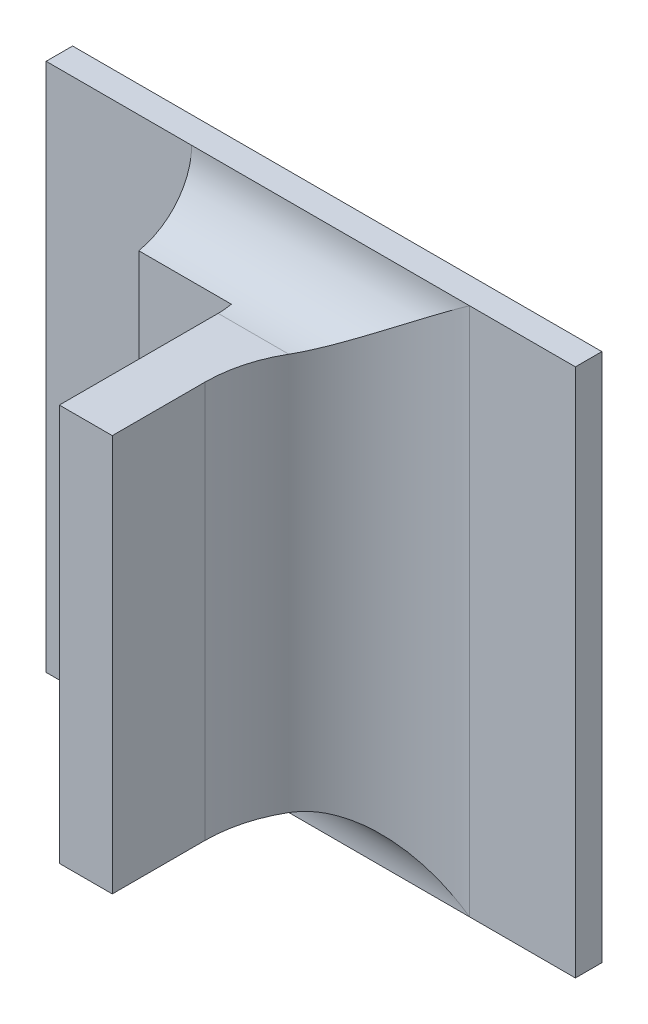
ISO-10303-21;
HEADER;
FILE_DESCRIPTION(('STEP AP214'),'2;1');
FILE_NAME('part.step','',(''),(''),'','','');
FILE_SCHEMA(('AUTOMOTIVE_DESIGN { 1 0 10303 214 1 1 1 1 }'));
ENDSEC;
DATA;
#1=APPLICATION_CONTEXT('core data for automotive mechanical design processes');
#2=APPLICATION_PROTOCOL_DEFINITION('international standard','automotive_design',2000,#1);
#3=PRODUCT_CONTEXT('',#1,'mechanical');
#4=PRODUCT('Part','Part','',(#3));
#5=PRODUCT_RELATED_PRODUCT_CATEGORY('part','',(#4));
#6=PRODUCT_DEFINITION_FORMATION('','',#4);
#7=PRODUCT_DEFINITION_CONTEXT('part definition',#1,'design');
#8=PRODUCT_DEFINITION('design','',#6,#7);
#9=PRODUCT_DEFINITION_SHAPE('','',#8);
#10=(LENGTH_UNIT() NAMED_UNIT(*) SI_UNIT(.MILLI.,.METRE.));
#11=(NAMED_UNIT(*) PLANE_ANGLE_UNIT() SI_UNIT($,.RADIAN.));
#12=(NAMED_UNIT(*) SI_UNIT($,.STERADIAN.) SOLID_ANGLE_UNIT());
#13=UNCERTAINTY_MEASURE_WITH_UNIT(LENGTH_MEASURE(1.E-05),#10,'distance_accuracy_value','');
#14=(GEOMETRIC_REPRESENTATION_CONTEXT(3) GLOBAL_UNCERTAINTY_ASSIGNED_CONTEXT((#13)) GLOBAL_UNIT_ASSIGNED_CONTEXT((#10,
#11,#12)) REPRESENTATION_CONTEXT('',''));
#15=CARTESIAN_POINT('',(0.,0.,0.));
#16=DIRECTION('',(0.,0.,1.));
#17=DIRECTION('',(1.,0.,0.));
#18=AXIS2_PLACEMENT_3D('',#15,#16,#17);
#19=CARTESIAN_POINT('',(1.10065854933629,-0.311549667580545,0.0796271653543306));
#20=DIRECTION('',(-1.,0.,0.));
#21=DIRECTION('',(0.,-1.,0.));
#22=AXIS2_PLACEMENT_3D('',#19,#20,#21);
#23=PLANE('',#22);
#24=DIRECTION('',(0.,-1.,0.));
#25=VECTOR('',#24,1.);
#26=CARTESIAN_POINT('',(1.10065854933629,-0.360053604588419,0.0800681102362204));
#27=LINE('',#26,#25);
#28=CARTESIAN_POINT('',(1.10065854933629,-0.351234706950624,0.0800681102362204));
#29=VERTEX_POINT('',#28);
#30=CARTESIAN_POINT('',(1.10065854933629,-0.313439431360073,0.0800681102362204));
#31=VERTEX_POINT('',#30);
#32=EDGE_CURVE('E116',#29,#31,#27,.F.);
#33=ORIENTED_EDGE('',*,*,#32,.T.);
#34=DIRECTION('',(0.,0.,1.));
#35=VECTOR('',#34,1.);
#36=CARTESIAN_POINT('',(1.10065854933629,-0.313439431360073,0.0730129921259841));
#37=LINE('',#36,#35);
#38=CARTESIAN_POINT('',(1.10065854933629,-0.313439431360073,0.0888870078740156));
#39=VERTEX_POINT('',#38);
#40=EDGE_CURVE('E294',#39,#31,#37,.F.);
#41=ORIENTED_EDGE('',*,*,#40,.F.);
#42=DIRECTION('',(0.,1.,0.));
#43=VECTOR('',#42,1.);
#44=CARTESIAN_POINT('',(1.10065854933629,-0.311549667580545,0.0888870078740156));
#45=LINE('',#44,#43);
#46=CARTESIAN_POINT('',(1.10065854933629,-0.351234706950624,0.0888870078740156));
#47=VERTEX_POINT('',#46);
#48=EDGE_CURVE('E306',#39,#47,#45,.F.);
#49=ORIENTED_EDGE('',*,*,#48,.T.);
#50=DIRECTION('',(0.,0.,1.));
#51=VECTOR('',#50,1.);
#52=CARTESIAN_POINT('',(1.10065854933629,-0.351234706950624,0.0730129921259841));
#53=LINE('',#52,#51);
#54=EDGE_CURVE('E305',#47,#29,#53,.F.);
#55=ORIENTED_EDGE('',*,*,#54,.T.);
#56=EDGE_LOOP('',(#33,#41,#49,#55));
#57=FACE_BOUND('',#56,.T.);
#58=ADVANCED_FACE('F17',(#57),#23,.F.);
#59=CARTESIAN_POINT('',(1.09536721075361,-0.311549667580545,0.0888870078740156));
#60=DIRECTION('',(0.,0.,-1.));
#61=DIRECTION('',(-1.,0.,0.));
#62=AXIS2_PLACEMENT_3D('',#59,#60,#61);
#63=PLANE('',#62);
#64=DIRECTION('',(0.,1.,0.));
#65=VECTOR('',#64,1.);
#66=CARTESIAN_POINT('',(1.09561917925755,-0.35326446766354,0.0888870078740156));
#67=LINE('',#66,#65);
#68=CARTESIAN_POINT('',(1.09561917925755,-0.313439431360073,0.0888870078740156));
#69=VERTEX_POINT('',#68);
#70=CARTESIAN_POINT('',(1.09561917925755,-0.351234706950624,0.0888870078740156));
#71=VERTEX_POINT('',#70);
#72=EDGE_CURVE('E297',#69,#71,#67,.F.);
#73=ORIENTED_EDGE('',*,*,#72,.T.);
#74=DIRECTION('',(-1.,0.,0.));
#75=VECTOR('',#74,1.);
#76=CARTESIAN_POINT('',(1.10268278021536,-0.351234706950624,0.0888870078740156));
#77=LINE('',#76,#75);
#78=EDGE_CURVE('E302',#71,#47,#77,.F.);
#79=ORIENTED_EDGE('',*,*,#78,.T.);
#80=ORIENTED_EDGE('',*,*,#48,.F.);
#81=DIRECTION('',(-1.,0.,0.));
#82=VECTOR('',#81,1.);
#83=CARTESIAN_POINT('',(1.10268278021536,-0.313439431360073,0.0888870078740156));
#84=LINE('',#83,#82);
#85=EDGE_CURVE('E291',#69,#39,#84,.F.);
#86=ORIENTED_EDGE('',*,*,#85,.F.);
#87=EDGE_LOOP('',(#73,#79,#80,#86));
#88=FACE_BOUND('',#87,.T.);
#89=ADVANCED_FACE('F321',(#88),#63,.F.);
#90=CARTESIAN_POINT('',(1.10268278021536,-0.351234706950624,0.0730129921259841));
#91=DIRECTION('',(0.,1.,0.));
#92=DIRECTION('',(-1.,0.,0.));
#93=AXIS2_PLACEMENT_3D('',#90,#91,#92);
#94=PLANE('',#93);
#95=DIRECTION('',(-1.,0.,0.));
#96=VECTOR('',#95,1.);
#97=CARTESIAN_POINT('',(1.06034358870637,-0.351234706950624,0.0737688976377952));
#98=LINE('',#97,#96);
#99=CARTESIAN_POINT('',(1.09561917925755,-0.351234706950624,0.0737688976377952));
#100=VERTEX_POINT('',#99);
#101=CARTESIAN_POINT('',(1.10234641826499,-0.351234706950624,0.0737688976377951));
#102=VERTEX_POINT('',#101);
#103=EDGE_CURVE('E127',#100,#102,#98,.F.);
#104=ORIENTED_EDGE('',*,*,#103,.T.);
#105=CARTESIAN_POINT('',(1.11325697453314,-0.351234706950624,0.0800681102362204));
#106=DIRECTION('',(0.,-1.,0.));
#107=DIRECTION('',(1.,0.,0.));
#108=AXIS2_PLACEMENT_3D('',#105,#106,#107);
#109=CIRCLE('',#108,0.0125984251968504);
#110=EDGE_CURVE('E20',#102,#29,#109,.F.);
#111=ORIENTED_EDGE('',*,*,#110,.T.);
#112=ORIENTED_EDGE('',*,*,#54,.F.);
#113=ORIENTED_EDGE('',*,*,#78,.F.);
#114=DIRECTION('',(0.,0.,1.));
#115=VECTOR('',#114,1.);
#116=CARTESIAN_POINT('',(1.09561917925755,-0.351234706950624,0.0716901574803148));
#117=LINE('',#116,#115);
#118=EDGE_CURVE('E135',#71,#100,#117,.F.);
#119=ORIENTED_EDGE('',*,*,#118,.T.);
#120=EDGE_LOOP('',(#104,#111,#112,#113,#119));
#121=FACE_BOUND('',#120,.T.);
#122=ADVANCED_FACE('F133',(#121),#94,.F.);
#123=CARTESIAN_POINT('',(1.08635933673786,-0.311409670647157,0.0725090551181101));
#124=DIRECTION('',(0.,0.,-1.));
#125=DIRECTION('',(-1.,0.,0.));
#126=AXIS2_PLACEMENT_3D('',#123,#124,#125);
#127=PLANE('',#126);
#128=DIRECTION('',(1.,0.,0.));
#129=VECTOR('',#128,1.);
#130=CARTESIAN_POINT('',(1.11457980917881,-0.313312161420629,0.0725090551181101));
#131=LINE('',#130,#129);
#132=CARTESIAN_POINT('',(1.09561917925755,-0.313312161420629,0.0725090551181101));
#133=VERTEX_POINT('',#132);
#134=CARTESIAN_POINT('',(1.08680028161975,-0.313312161420629,0.0725090551181101));
#135=VERTEX_POINT('',#134);
#136=EDGE_CURVE('E142',#133,#135,#131,.F.);
#137=ORIENTED_EDGE('',*,*,#136,.T.);
#138=DIRECTION('',(0.,1.,0.));
#139=VECTOR('',#138,1.);
#140=CARTESIAN_POINT('',(1.08680028161975,-0.304620533722278,0.0725090551181101));
#141=LINE('',#140,#139);
#142=CARTESIAN_POINT('',(1.08680028161975,-0.351361976890068,0.0725090551181101));
#143=VERTEX_POINT('',#142);
#144=EDGE_CURVE('E146',#135,#143,#141,.F.);
#145=ORIENTED_EDGE('',*,*,#144,.T.);
#146=DIRECTION('',(-1.,0.,0.));
#147=VECTOR('',#146,1.);
#148=CARTESIAN_POINT('',(1.06034358870637,-0.351361976890068,0.0725090551181101));
#149=LINE('',#148,#147);
#150=CARTESIAN_POINT('',(1.09561917925755,-0.351361976890068,0.0725090551181101));
#151=VERTEX_POINT('',#150);
#152=EDGE_CURVE('E138',#143,#151,#149,.F.);
#153=ORIENTED_EDGE('',*,*,#152,.T.);
#154=DIRECTION('',(0.,1.,0.));
#155=VECTOR('',#154,1.);
#156=CARTESIAN_POINT('',(1.09561917925755,-0.35326446766354,0.0725090551181101));
#157=LINE('',#156,#155);
#158=EDGE_CURVE('E324',#151,#133,#157,.T.);
#159=ORIENTED_EDGE('',*,*,#158,.T.);
#160=EDGE_LOOP('',(#137,#145,#153,#159));
#161=FACE_BOUND('',#160,.T.);
#162=ADVANCED_FACE('F193',(#161),#127,.F.);
#163=CARTESIAN_POINT('',(1.11325697453314,-0.360053604588419,0.0800681102362204));
#164=DIRECTION('',(0.,-1.,0.));
#165=DIRECTION('',(1.,0.,0.));
#166=AXIS2_PLACEMENT_3D('',#163,#164,#165);
#167=CYLINDRICAL_SURFACE('',#166,0.0125984251968504);
#168=CARTESIAN_POINT('',(1.10234641826499,-0.351234706950624,0.073768897637795));
#169=CARTESIAN_POINT('',(1.10261890276947,-0.351235264602844,0.0732955457546591));
#170=CARTESIAN_POINT('',(1.10292101489507,-0.351287791933283,0.0728445682080297));
#171=CARTESIAN_POINT('',(1.10356648266907,-0.351472774611581,0.0720003898002663));
#172=CARTESIAN_POINT('',(1.10390921514433,-0.351604122731851,0.0716064807283954));
#173=CARTESIAN_POINT('',(1.1046944522691,-0.351954482138244,0.0708064921171963));
#174=CARTESIAN_POINT('',(1.10514352339741,-0.352185429374069,0.0704123993317733));
#175=CARTESIAN_POINT('',(1.10607344965901,-0.352703528005895,0.0697017381084181));
#176=CARTESIAN_POINT('',(1.1065544829297,-0.352991015612919,0.0693856602556568));
#177=CARTESIAN_POINT('',(1.1077352203742,-0.353727172372372,0.0687164538298326));
#178=CARTESIAN_POINT('',(1.10844449748557,-0.354193928271791,0.0684002761150405));
#179=CARTESIAN_POINT('',(1.10988152520042,-0.355165489292896,0.0679065689436589));
#180=CARTESIAN_POINT('',(1.1106092439602,-0.355670231444697,0.0677288153407497));
#181=CARTESIAN_POINT('',(1.11178520652968,-0.356494415867953,0.0675478835698786));
#182=CARTESIAN_POINT('',(1.11223106131395,-0.356808848945618,0.0675035718032502));
#183=CARTESIAN_POINT('',(1.11287048235852,-0.357260628255393,0.0674741343290926));
#184=CARTESIAN_POINT('',(1.11306373300818,-0.357397277676518,0.0674696949622004));
#185=CARTESIAN_POINT('',(1.11325697453314,-0.357533919549049,0.06746968503937));
#186=B_SPLINE_CURVE_WITH_KNOTS('',3,(#168,#169,#170,#171,#172,#173,#174,#175,#176,#177,#178,
#179,#180,#181,#182,#183,#184,#185),.UNSPECIFIED.,.F.,.F.,(4,2,2,2,2,2,2,2,4),(0.,
0.00162828046163546,0.00323420635682074,0.00514617952943936,0.00706988591555799,
0.00977367423346215,0.012473075225337,0.0141132082090729,0.014823218803943),.UNSPECIFIED.);
#187=CARTESIAN_POINT('',(1.11325697453314,-0.357533919549049,0.06746968503937));
#188=VERTEX_POINT('',#187);
#189=EDGE_CURVE('E113',#102,#188,#186,.T.);
#190=ORIENTED_EDGE('',*,*,#189,.T.);
#191=DIRECTION('',(0.,1.,0.));
#192=VECTOR('',#191,1.);
#193=CARTESIAN_POINT('',(1.11325697453314,-0.304620533722278,0.06746968503937));
#194=LINE('',#193,#192);
#195=CARTESIAN_POINT('',(1.11325697453314,-0.307140218761648,0.06746968503937));
#196=VERTEX_POINT('',#195);
#197=EDGE_CURVE('E279',#196,#188,#194,.F.);
#198=ORIENTED_EDGE('',*,*,#197,.F.);
#199=CARTESIAN_POINT('',(1.11325697453314,-0.307140218761648,0.06746968503937));
#200=CARTESIAN_POINT('',(1.11325697443883,-0.307140317600168,0.0674696850393615));
#201=CARTESIAN_POINT('',(1.11325696428831,-0.307140416428938,0.0674696850424135));
#202=CARTESIAN_POINT('',(1.11325692844536,-0.307140611354748,0.0674696850532618));
#203=CARTESIAN_POINT('',(1.11325690268731,-0.307140707438454,0.0674696850610781));
#204=CARTESIAN_POINT('',(1.11325683876529,-0.307140897584729,0.0674696850805152));
#205=CARTESIAN_POINT('',(1.11325680034771,-0.30714099156009,0.0674696850922137));
#206=CARTESIAN_POINT('',(1.11325671409872,-0.307141174837888,0.0674696851185221));
#207=CARTESIAN_POINT('',(1.11325666627737,-0.307141264145186,0.067469685133129));
#208=CARTESIAN_POINT('',(1.11325650386637,-0.307141540902339,0.0674696851828237));
#209=CARTESIAN_POINT('',(1.11325637660556,-0.307141720962886,0.0674696852218837));
#210=CARTESIAN_POINT('',(1.11325610177284,-0.307142061590547,0.0674696853066755));
#211=CARTESIAN_POINT('',(1.11325595436569,-0.307142222297702,0.0674696853523532));
#212=CARTESIAN_POINT('',(1.11325542712555,-0.30714275975848,0.0674696855167746));
#213=CARTESIAN_POINT('',(1.1132550209339,-0.307143110950677,0.0674696856452023));
#214=CARTESIAN_POINT('',(1.11325418097794,-0.307143742641604,0.0674696859163222));
#215=CARTESIAN_POINT('',(1.11325374865666,-0.307144025168177,0.0674696860583659));
#216=CARTESIAN_POINT('',(1.11325207047987,-0.307145088805981,0.0674696866214032));
#217=CARTESIAN_POINT('',(1.11325079788728,-0.307145826268706,0.0674696870727232));
#218=CARTESIAN_POINT('',(1.11324832352845,-0.307147133962223,0.0674696882497374));
#219=CARTESIAN_POINT('',(1.11324712675437,-0.307147713460052,0.0674696889448008));
#220=CARTESIAN_POINT('',(1.11323926691833,-0.307151849249196,0.0674696947394657));
#221=CARTESIAN_POINT('',(1.11323331635703,-0.307156609323054,0.067469705198469));
#222=CARTESIAN_POINT('',(1.11321123423804,-0.307173483152929,0.0674697594501571));
#223=CARTESIAN_POINT('',(1.11319458949083,-0.307184696077487,0.0674698297573796));
#224=CARTESIAN_POINT('',(1.11313382174648,-0.307226386954017,0.0674702062030111));
#225=CARTESIAN_POINT('',(1.1130902162084,-0.307257775090299,0.0674707100991553));
#226=CARTESIAN_POINT('',(1.11292384861855,-0.307376764604737,0.0674735003948733));
#227=CARTESIAN_POINT('',(1.11280055643069,-0.307463363679941,0.0674773623702134));
#228=CARTESIAN_POINT('',(1.11176052177526,-0.308194415116372,0.0675251688134003));
#229=CARTESIAN_POINT('',(1.11084596611058,-0.308840824556344,0.0676670910917156));
#230=CARTESIAN_POINT('',(1.10918262551351,-0.309985925569803,0.0681207439021359));
#231=CARTESIAN_POINT('',(1.10843045895855,-0.310491829145844,0.0684021380812103));
#232=CARTESIAN_POINT('',(1.10720054658299,-0.311283401329248,0.0690071450776349));
#233=CARTESIAN_POINT('',(1.10671313105087,-0.311587175065945,0.0692872417521838));
#234=CARTESIAN_POINT('',(1.10574606227079,-0.312158547189347,0.0699361732585047));
#235=CARTESIAN_POINT('',(1.10526722125112,-0.312424585539931,0.0703076754457102));
#236=CARTESIAN_POINT('',(1.10446921276298,-0.312823166861075,0.0710290250498738));
#237=CARTESIAN_POINT('',(1.10414088565085,-0.31297243520059,0.0713594163896827));
#238=CARTESIAN_POINT('',(1.10351681043465,-0.313215602302386,0.0720638443645074));
#239=CARTESIAN_POINT('',(1.10322081460992,-0.313309950219131,0.0724374961036001));
#240=CARTESIAN_POINT('',(1.10272701699477,-0.313415914374917,0.0731410386617688));
#241=CARTESIAN_POINT('',(1.10252166045462,-0.31344076414939,0.0734635869359734));
#242=CARTESIAN_POINT('',(1.10214103529335,-0.313437989894047,0.0741265585439531));
#243=CARTESIAN_POINT('',(1.10196578800616,-0.31341032882348,0.0744669943307325));
#244=CARTESIAN_POINT('',(1.10164914342728,-0.313294679389271,0.0751565544091362));
#245=CARTESIAN_POINT('',(1.10150798460914,-0.313206281764493,0.0755057220621307));
#246=CARTESIAN_POINT('',(1.10126317815291,-0.312965001062621,0.0761947785868873));
#247=CARTESIAN_POINT('',(1.10115950288724,-0.312812165660658,0.076534674121198));
#248=CARTESIAN_POINT('',(1.10099779917462,-0.312466071945116,0.0771489075153615));
#249=CARTESIAN_POINT('',(1.10093578034486,-0.312279886373216,0.0774262133810266));
#250=CARTESIAN_POINT('',(1.1008349727764,-0.311863410254162,0.0779502251276347));
#251=CARTESIAN_POINT('',(1.10079618395166,-0.311633119870385,0.0781969311219234));
#252=CARTESIAN_POINT('',(1.10073691438072,-0.311139310998908,0.0786471201676946));
#253=CARTESIAN_POINT('',(1.10071611863725,-0.310876460373297,0.0788512972752939));
#254=CARTESIAN_POINT('',(1.10068606880267,-0.31032143341996,0.0792159384509798));
#255=CARTESIAN_POINT('',(1.10067681628568,-0.310029253098466,0.079376396554856));
#256=CARTESIAN_POINT('',(1.10066451824179,-0.309410568564247,0.0796549300095398));
#257=CARTESIAN_POINT('',(1.10066174556578,-0.309083144094315,0.0797709755115422));
#258=CARTESIAN_POINT('',(1.1006588120244,-0.308413669505017,0.0799477574285474));
#259=CARTESIAN_POINT('',(1.10065865145093,-0.308071617755308,0.0800084876612566));
#260=CARTESIAN_POINT('',(1.10065850513026,-0.307374847298272,0.0800736589499428));
#261=CARTESIAN_POINT('',(1.10065852316003,-0.307020013767971,0.0800768798691539));
#262=CARTESIAN_POINT('',(1.10065860056997,-0.306314811859268,0.0800238026376848));
#263=CARTESIAN_POINT('',(1.10065865995291,-0.305964443781738,0.0799675004977202));
#264=CARTESIAN_POINT('',(1.10066118345469,-0.305277507288453,0.0797968199531622));
#265=CARTESIAN_POINT('',(1.1006636517146,-0.304940963676405,0.0796823417014522));
#266=CARTESIAN_POINT('',(1.1006755577209,-0.30429193671443,0.079398533160437));
#267=CARTESIAN_POINT('',(1.10068499571833,-0.30397945423159,0.079229200895512));
#268=CARTESIAN_POINT('',(1.10071686610112,-0.303389548026495,0.078841988199416));
#269=CARTESIAN_POINT('',(1.10073921968553,-0.303111924019512,0.0786244070629531));
#270=CARTESIAN_POINT('',(1.10080350767794,-0.302598008180998,0.0781473882147606));
#271=CARTESIAN_POINT('',(1.10084543461465,-0.30236170062595,0.0778879664985859));
#272=CARTESIAN_POINT('',(1.1009530271785,-0.301944772977547,0.0773466142760768));
#273=CARTESIAN_POINT('',(1.10101781463972,-0.301762499248574,0.0770657832005056));
#274=CARTESIAN_POINT('',(1.10117507606754,-0.301447086827108,0.0764850450664439));
#275=CARTESIAN_POINT('',(1.10126754153052,-0.301313933071312,0.0761851438891881));
#276=CARTESIAN_POINT('',(1.10147846113475,-0.301100802250232,0.0755865038391838));
#277=CARTESIAN_POINT('',(1.10159610402998,-0.301019424424719,0.0752879731287242));
#278=CARTESIAN_POINT('',(1.10185781902439,-0.300901879920434,0.0746936193238617));
#279=CARTESIAN_POINT('',(1.10200190499721,-0.300865737052864,0.0743977977367697));
#280=CARTESIAN_POINT('',(1.10232401499384,-0.300833457265666,0.0737980252798642));
#281=CARTESIAN_POINT('',(1.10250363576731,-0.300840072083108,0.0734947949351434));
#282=CARTESIAN_POINT('',(1.10288546654942,-0.300893220663338,0.0729074487273724));
#283=CARTESIAN_POINT('',(1.10308765539436,-0.300939717295166,0.07262331534983));
#284=CARTESIAN_POINT('',(1.10362236409069,-0.301099160254376,0.0719334846819084));
#285=CARTESIAN_POINT('',(1.10396744068269,-0.301234206619572,0.0715425793781453));
#286=CARTESIAN_POINT('',(1.10469211824112,-0.301562359739769,0.0708143812686403));
#287=CARTESIAN_POINT('',(1.1050720571188,-0.301756088608605,0.0704777252629507));
#288=CARTESIAN_POINT('',(1.10602672299861,-0.302279339643324,0.0697260645086063));
#289=CARTESIAN_POINT('',(1.10661350381228,-0.302631080843893,0.0693419139325728));
#290=CARTESIAN_POINT('',(1.10778838585876,-0.303370485460523,0.0686995101782903));
#291=CARTESIAN_POINT('',(1.10837539859386,-0.303756022313255,0.0684366507296656));
#292=CARTESIAN_POINT('',(1.10952428856556,-0.304528568289244,0.0680209366897775));
#293=CARTESIAN_POINT('',(1.11008520903677,-0.304913742395931,0.0678618837368313));
#294=CARTESIAN_POINT('',(1.1113216031066,-0.305774456157341,0.0676002423539604));
#295=CARTESIAN_POINT('',(1.11199849379879,-0.306253204314874,0.0675142406050075));
#296=CARTESIAN_POINT('',(1.11280003458979,-0.306816723517622,0.0674773844657497));
#297=CARTESIAN_POINT('',(1.11292282744822,-0.306902958808099,0.0674735321464732));
#298=CARTESIAN_POINT('',(1.11308904884134,-0.307021838644933,0.0674707243957126));
#299=CARTESIAN_POINT('',(1.11313300992244,-0.307053485081973,0.0674702128513251));
#300=CARTESIAN_POINT('',(1.11319425554291,-0.307095501849072,0.0674698312735403));
#301=CARTESIAN_POINT('',(1.11321101706482,-0.307106792621677,0.0674697601164234));
#302=CARTESIAN_POINT('',(1.11323323783695,-0.307123774563246,0.067469705327429));
#303=CARTESIAN_POINT('',(1.1132392147914,-0.307128556132832,0.0674696947878421));
#304=CARTESIAN_POINT('',(1.11324710881166,-0.307132705901442,0.0674696889590613));
#305=CARTESIAN_POINT('',(1.11324830876352,-0.307133286333551,0.0674696882612312));
#306=CARTESIAN_POINT('',(1.11325078959689,-0.307134597075485,0.0674696870796236));
#307=CARTESIAN_POINT('',(1.11325206542456,-0.307135336773202,0.0674696866266876));
#308=CARTESIAN_POINT('',(1.11325374726028,-0.307136403621154,0.0674696860616838));
#309=CARTESIAN_POINT('',(1.11325418021959,-0.307136686826689,0.0674696859192267));
#310=CARTESIAN_POINT('',(1.11325502129302,-0.307137320138761,0.0674696856472792));
#311=CARTESIAN_POINT('',(1.11325542795451,-0.307137672284289,0.0674696855184389));
#312=CARTESIAN_POINT('',(1.11325595560389,-0.30713821114919,0.0674696853534853));
#313=CARTESIAN_POINT('',(1.11325610307399,-0.307138372237131,0.067469685307667));
#314=CARTESIAN_POINT('',(1.11325637795344,-0.307138713663398,0.0674696852226042));
#315=CARTESIAN_POINT('',(1.11325650519712,-0.30713889414225,0.0674696851834138));
#316=CARTESIAN_POINT('',(1.11325666749389,-0.307139171508259,0.0674696851335454));
#317=CARTESIAN_POINT('',(1.1132567152638,-0.307139261001292,0.067469685118887));
#318=CARTESIAN_POINT('',(1.11325680137935,-0.30713944464998,0.0674696850924812));
#319=CARTESIAN_POINT('',(1.11325683971488,-0.307139538810509,0.067469685080737));
#320=CARTESIAN_POINT('',(1.11325690343592,-0.307139729312035,0.067469685061218));
#321=CARTESIAN_POINT('',(1.11325692907626,-0.307139825565832,0.0674696850533652));
#322=CARTESIAN_POINT('',(1.11325696463911,-0.307140020812425,0.0674696850424555));
#323=CARTESIAN_POINT('',(1.11325697462758,-0.307140119791924,0.0674696850393785));
#324=CARTESIAN_POINT('',(1.11325697453314,-0.307140218761648,0.06746968503937));
#325=B_SPLINE_CURVE_WITH_KNOTS('',3,(#199,#200,#201,#202,#203,#204,#205,#206,#207,#208,#209,
#210,#211,#212,#213,#214,#215,#216,#217,#218,#219,#220,#221,#222,#223,#224,#225,#226,#227,#228,
#229,#230,#231,#232,#233,#234,#235,#236,#237,#238,#239,#240,#241,#242,#243,#244,#245,#246,#247,
#248,#249,#250,#251,#252,#253,#254,#255,#256,#257,#258,#259,#260,#261,#262,#263,#264,#265,#266,
#267,#268,#269,#270,#271,#272,#273,#274,#275,#276,#277,#278,#279,#280,#281,#282,#283,#284,#285,
#286,#287,#288,#289,#290,#291,#292,#293,#294,#295,#296,#297,#298,#299,#300,#301,#302,#303,#304,
#305,#306,#307,#308,#309,#310,#311,#312,#313,#314,#315,#316,#317,#318,#319,#320,#321,#322,#323,
#324),.UNSPECIFIED.,.T.,.F.,(4,2,2,2,2,2,2,2,2,2,2,2,2,2,2,2,2,2,2,2,2,2,2,2,2,2,2,2,2,2,2,2,2,
2,2,2,2,2,2,2,2,2,2,2,2,2,2,2,2,2,2,2,2,2,2,2,2,2,2,2,2,2,4),(0.,2.96262718467022E-07,
5.9377935599324E-07,8.9766057151907E-07,1.20121869978616E-06,1.85983939931601E-06,
2.51336440042427E-06,4.11695718378894E-06,5.66498675241026E-06,1.00742722997459E-05,
1.40586629771078E-05,3.67471450075659E-05,9.70745534323149E-05,0.000258117828158545,
0.000710418104869135,0.00407475533961842,0.00690809627288576,0.00881968522125077,
0.0107955574621806,0.0122580167053816,0.0137083411294307,0.0148534027078702,0.0159992723041916,
0.0171529398267009,0.0183057552869511,0.0193199166517908,0.0203340742599354,0.0213300957694083,
0.0223262530896367,0.0233636546164693,0.0244011720739369,0.0254606762934845,0.0265202515263762,
0.0275816514712123,0.0286430896476356,0.0296981191234643,0.0307527462159096,0.0317706214790939,
0.0327881843370709,0.0337768943877514,0.034766124666293,0.0358196249691737,0.0368721455004046,
0.0384790134244904,0.040103550775021,0.0424440092075651,0.0446862628276771,0.0467780451238264,
0.0492693497424136,0.049719781732113,0.0498821419378973,0.0499428919104113,0.049965681046058,
0.0499696752051923,0.0499740961721066,0.049975646909701,0.0499772533934871,0.0499779078855008,
0.0499785674893831,0.049978871464854,0.0499791757647539,0.0499794736800123,0.0499797703360084),.UNSPECIFIED.);
#326=CARTESIAN_POINT('',(1.10234641826499,-0.313439431360073,0.0737688976377952));
#327=VERTEX_POINT('',#326);
#328=EDGE_CURVE('E197',#196,#327,#325,.T.);
#329=ORIENTED_EDGE('',*,*,#328,.T.);
#330=CARTESIAN_POINT('',(1.11325697453314,-0.313439431360073,0.0800681102362204));
#331=DIRECTION('',(0.,1.,0.));
#332=DIRECTION('',(-1.,0.,0.));
#333=AXIS2_PLACEMENT_3D('',#330,#331,#332);
#334=CIRCLE('',#333,0.0125984251968504);
#335=EDGE_CURVE('E121',#31,#327,#334,.F.);
#336=ORIENTED_EDGE('',*,*,#335,.F.);
#337=ORIENTED_EDGE('',*,*,#32,.F.);
#338=ORIENTED_EDGE('',*,*,#110,.F.);
#339=EDGE_LOOP('',(#190,#198,#329,#336,#337,#338));
#340=FACE_BOUND('',#339,.T.);
#341=ADVANCED_FACE('F111',(#340),#167,.F.);
#342=CARTESIAN_POINT('',(1.10268278021536,-0.313439431360073,0.0730129921259841));
#343=DIRECTION('',(0.,1.,0.));
#344=DIRECTION('',(-1.,0.,0.));
#345=AXIS2_PLACEMENT_3D('',#342,#343,#344);
#346=PLANE('',#345);
#347=ORIENTED_EDGE('',*,*,#85,.T.);
#348=ORIENTED_EDGE('',*,*,#40,.T.);
#349=ORIENTED_EDGE('',*,*,#335,.T.);
#350=DIRECTION('',(1.,0.,0.));
#351=VECTOR('',#350,1.);
#352=CARTESIAN_POINT('',(1.11457980917881,-0.313439431360073,0.0737688976377952));
#353=LINE('',#352,#351);
#354=CARTESIAN_POINT('',(1.09561917925755,-0.313439431360073,0.0737688976377952));
#355=VERTEX_POINT('',#354);
#356=EDGE_CURVE('E266',#327,#355,#353,.F.);
#357=ORIENTED_EDGE('',*,*,#356,.T.);
#358=DIRECTION('',(0.,0.,1.));
#359=VECTOR('',#358,1.);
#360=CARTESIAN_POINT('',(1.09561917925755,-0.313439431360073,0.0716901574803148));
#361=LINE('',#360,#359);
#362=EDGE_CURVE('E149',#355,#69,#361,.T.);
#363=ORIENTED_EDGE('',*,*,#362,.T.);
#364=EDGE_LOOP('',(#347,#348,#349,#357,#363));
#365=FACE_BOUND('',#364,.T.);
#366=ADVANCED_FACE('F183',(#365),#346,.T.);
#367=CARTESIAN_POINT('',(1.09561917925755,-0.35326446766354,0.0716901574803148));
#368=DIRECTION('',(1.,0.,0.));
#369=DIRECTION('',(0.,1.,0.));
#370=AXIS2_PLACEMENT_3D('',#367,#368,#369);
#371=PLANE('',#370);
#372=CARTESIAN_POINT('',(1.09561917925755,-0.313312161420629,0.0725090551181101));
#373=CARTESIAN_POINT('',(1.09561917925755,-0.313439431360073,0.0731325479405746));
#374=CARTESIAN_POINT('',(1.09561917925755,-0.313439431360073,0.0737688976377952));
#375=B_SPLINE_CURVE_WITH_KNOTS('',2,(#372,#373,#374),.UNSPECIFIED.,.F.,.F.,(3,3),(0.,1.),.UNSPECIFIED.);
#376=EDGE_CURVE('E153',#355,#133,#375,.F.);
#377=ORIENTED_EDGE('',*,*,#376,.T.);
#378=ORIENTED_EDGE('',*,*,#158,.F.);
#379=CARTESIAN_POINT('',(1.09561917925755,-0.351234706950624,0.0737688976377952));
#380=CARTESIAN_POINT('',(1.09561917925755,-0.351234706950624,0.0731325479405747));
#381=CARTESIAN_POINT('',(1.09561917925755,-0.351361976890068,0.0725090551181101));
#382=B_SPLINE_CURVE_WITH_KNOTS('',2,(#379,#380,#381),.UNSPECIFIED.,.F.,.F.,(3,3),(0.,1.),.UNSPECIFIED.);
#383=EDGE_CURVE('E136',#151,#100,#382,.F.);
#384=ORIENTED_EDGE('',*,*,#383,.T.);
#385=ORIENTED_EDGE('',*,*,#118,.F.);
#386=ORIENTED_EDGE('',*,*,#72,.F.);
#387=ORIENTED_EDGE('',*,*,#362,.F.);
#388=EDGE_LOOP('',(#377,#378,#384,#385,#386,#387));
#389=FACE_BOUND('',#388,.T.);
#390=ADVANCED_FACE('F172',(#389),#371,.F.);
#391=CARTESIAN_POINT('',(1.08680028161975,-0.304620533722278,0.067217716535433));
#392=DIRECTION('',(1.,0.,0.));
#393=DIRECTION('',(0.,1.,0.));
#394=AXIS2_PLACEMENT_3D('',#391,#392,#393);
#395=PLANE('',#394);
#396=CARTESIAN_POINT('',(1.08680028161975,-0.307140218761648,0.0737688976377952));
#397=DIRECTION('',(1.,0.,0.));
#398=DIRECTION('',(0.,1.,0.));
#399=AXIS2_PLACEMENT_3D('',#396,#397,#398);
#400=CIRCLE('',#399,0.0062992125984252);
#401=CARTESIAN_POINT('',(1.08680028161975,-0.307140218761648,0.06746968503937));
#402=VERTEX_POINT('',#401);
#403=EDGE_CURVE('E272',#135,#402,#400,.T.);
#404=ORIENTED_EDGE('',*,*,#403,.T.);
#405=DIRECTION('',(0.,1.,0.));
#406=VECTOR('',#405,1.);
#407=CARTESIAN_POINT('',(1.08680028161975,-0.304620533722278,0.06746968503937));
#408=LINE('',#407,#406);
#409=CARTESIAN_POINT('',(1.08680028161975,-0.357533919549049,0.06746968503937));
#410=VERTEX_POINT('',#409);
#411=EDGE_CURVE('E150',#410,#402,#408,.T.);
#412=ORIENTED_EDGE('',*,*,#411,.F.);
#413=CARTESIAN_POINT('',(1.08680028161975,-0.357533919549049,0.0737688976377952));
#414=DIRECTION('',(-1.,0.,0.));
#415=DIRECTION('',(0.,-1.,0.));
#416=AXIS2_PLACEMENT_3D('',#413,#414,#415);
#417=CIRCLE('',#416,0.0062992125984252);
#418=EDGE_CURVE('E131',#410,#143,#417,.F.);
#419=ORIENTED_EDGE('',*,*,#418,.T.);
#420=ORIENTED_EDGE('',*,*,#144,.F.);
#421=EDGE_LOOP('',(#404,#412,#419,#420));
#422=FACE_BOUND('',#421,.T.);
#423=ADVANCED_FACE('F182',(#422),#395,.F.);
#424=CARTESIAN_POINT('',(1.06034358870637,-0.357533919549049,0.0737688976377952));
#425=DIRECTION('',(-1.,0.,0.));
#426=DIRECTION('',(0.,-1.,0.));
#427=AXIS2_PLACEMENT_3D('',#424,#425,#426);
#428=CYLINDRICAL_SURFACE('',#427,0.0062992125984252);
#429=DIRECTION('',(-1.,0.,0.));
#430=VECTOR('',#429,1.);
#431=CARTESIAN_POINT('',(1.12585539972999,-0.357533919549049,0.06746968503937));
#432=LINE('',#431,#430);
#433=EDGE_CURVE('E130',#410,#188,#432,.F.);
#434=ORIENTED_EDGE('',*,*,#433,.T.);
#435=ORIENTED_EDGE('',*,*,#189,.F.);
#436=ORIENTED_EDGE('',*,*,#103,.F.);
#437=ORIENTED_EDGE('',*,*,#383,.F.);
#438=ORIENTED_EDGE('',*,*,#152,.F.);
#439=ORIENTED_EDGE('',*,*,#418,.F.);
#440=EDGE_LOOP('',(#434,#435,#436,#437,#438,#439));
#441=FACE_BOUND('',#440,.T.);
#442=ADVANCED_FACE('F125',(#441),#428,.F.);
#443=CARTESIAN_POINT('',(1.12383965169849,-0.304620533722278,0.06746968503937));
#444=DIRECTION('',(0.,0.,1.));
#445=DIRECTION('',(1.,0.,0.));
#446=AXIS2_PLACEMENT_3D('',#443,#444,#445);
#447=PLANE('',#446);
#448=DIRECTION('',(0.,-1.,0.));
#449=VECTOR('',#448,1.);
#450=CARTESIAN_POINT('',(1.12333571469062,-0.304620533722278,0.06746968503937));
#451=LINE('',#450,#449);
#452=CARTESIAN_POINT('',(1.12333571469062,-0.357533919549049,0.06746968503937));
#453=VERTEX_POINT('',#452);
#454=CARTESIAN_POINT('',(1.12333571469062,-0.307140218761648,0.06746968503937));
#455=VERTEX_POINT('',#454);
#456=EDGE_CURVE('E262',#453,#455,#451,.F.);
#457=ORIENTED_EDGE('',*,*,#456,.T.);
#458=DIRECTION('',(1.,0.,0.));
#459=VECTOR('',#458,1.);
#460=CARTESIAN_POINT('',(1.07042232886385,-0.307140218761648,0.06746968503937));
#461=LINE('',#460,#459);
#462=EDGE_CURVE('E166',#455,#196,#461,.F.);
#463=ORIENTED_EDGE('',*,*,#462,.T.);
#464=ORIENTED_EDGE('',*,*,#197,.T.);
#465=DIRECTION('',(-1.,0.,0.));
#466=VECTOR('',#465,1.);
#467=CARTESIAN_POINT('',(1.12585539972999,-0.357533919549049,0.06746968503937));
#468=LINE('',#467,#466);
#469=EDGE_CURVE('E155',#188,#453,#468,.F.);
#470=ORIENTED_EDGE('',*,*,#469,.T.);
#471=EDGE_LOOP('',(#457,#463,#464,#470));
#472=FACE_BOUND('',#471,.T.);
#473=ADVANCED_FACE('F211',(#472),#447,.T.);
#474=CARTESIAN_POINT('',(1.11457980917881,-0.307140218761648,0.0737688976377952));
#475=DIRECTION('',(1.,0.,0.));
#476=DIRECTION('',(0.,1.,0.));
#477=AXIS2_PLACEMENT_3D('',#474,#475,#476);
#478=CYLINDRICAL_SURFACE('',#477,0.0062992125984252);
#479=ORIENTED_EDGE('',*,*,#356,.F.);
#480=ORIENTED_EDGE('',*,*,#328,.F.);
#481=DIRECTION('',(1.,0.,0.));
#482=VECTOR('',#481,1.);
#483=CARTESIAN_POINT('',(1.07042232886385,-0.307140218761648,0.06746968503937));
#484=LINE('',#483,#482);
#485=EDGE_CURVE('E164',#196,#402,#484,.F.);
#486=ORIENTED_EDGE('',*,*,#485,.T.);
#487=ORIENTED_EDGE('',*,*,#403,.F.);
#488=ORIENTED_EDGE('',*,*,#136,.F.);
#489=ORIENTED_EDGE('',*,*,#376,.F.);
#490=EDGE_LOOP('',(#479,#480,#486,#487,#488,#489));
#491=FACE_BOUND('',#490,.T.);
#492=ADVANCED_FACE('F213',(#491),#478,.F.);
#493=CARTESIAN_POINT('',(1.08749319500558,-0.304620533722278,0.06746968503937));
#494=DIRECTION('',(0.,0.,1.));
#495=DIRECTION('',(1.,0.,0.));
#496=AXIS2_PLACEMENT_3D('',#493,#494,#495);
#497=PLANE('',#496);
#498=DIRECTION('',(1.,0.,0.));
#499=VECTOR('',#498,1.);
#500=CARTESIAN_POINT('',(1.07042232886385,-0.307140218761648,0.06746968503937));
#501=LINE('',#500,#499);
#502=CARTESIAN_POINT('',(1.07294201390322,-0.307140218761648,0.06746968503937));
#503=VERTEX_POINT('',#502);
#504=EDGE_CURVE('E160',#402,#503,#501,.F.);
#505=ORIENTED_EDGE('',*,*,#504,.T.);
#506=DIRECTION('',(0.,1.,0.));
#507=VECTOR('',#506,1.);
#508=CARTESIAN_POINT('',(1.07294201390322,-0.360053604588419,0.06746968503937));
#509=LINE('',#508,#507);
#510=CARTESIAN_POINT('',(1.07294201390322,-0.357533919549049,0.06746968503937));
#511=VERTEX_POINT('',#510);
#512=EDGE_CURVE('E152',#503,#511,#509,.F.);
#513=ORIENTED_EDGE('',*,*,#512,.T.);
#514=DIRECTION('',(-1.,0.,0.));
#515=VECTOR('',#514,1.);
#516=CARTESIAN_POINT('',(1.12585539972999,-0.357533919549049,0.06746968503937));
#517=LINE('',#516,#515);
#518=EDGE_CURVE('E156',#511,#410,#517,.F.);
#519=ORIENTED_EDGE('',*,*,#518,.T.);
#520=ORIENTED_EDGE('',*,*,#411,.T.);
#521=EDGE_LOOP('',(#505,#513,#519,#520));
#522=FACE_BOUND('',#521,.T.);
#523=ADVANCED_FACE('F218',(#522),#497,.T.);
#524=CARTESIAN_POINT('',(1.07294201390322,-0.360053604588419,0.0648240157480314));
#525=DIRECTION('',(1.,0.,0.));
#526=DIRECTION('',(0.,1.,0.));
#527=AXIS2_PLACEMENT_3D('',#524,#525,#526);
#528=PLANE('',#527);
#529=DIRECTION('',(0.,0.,1.));
#530=VECTOR('',#529,1.);
#531=CARTESIAN_POINT('',(1.07294201390322,-0.357533919549049,0.0648240157480314));
#532=LINE('',#531,#530);
#533=CARTESIAN_POINT('',(1.07294201390322,-0.357533919549049,0.0649499999999999));
#534=VERTEX_POINT('',#533);
#535=EDGE_CURVE('E159',#534,#511,#532,.T.);
#536=ORIENTED_EDGE('',*,*,#535,.T.);
#537=ORIENTED_EDGE('',*,*,#512,.F.);
#538=DIRECTION('',(0.,0.,1.));
#539=VECTOR('',#538,1.);
#540=CARTESIAN_POINT('',(1.07294201390322,-0.307140218761648,0.0648240157480314));
#541=LINE('',#540,#539);
#542=CARTESIAN_POINT('',(1.07294201390322,-0.307140218761648,0.0649499999999999));
#543=VERTEX_POINT('',#542);
#544=EDGE_CURVE('E163',#503,#543,#541,.F.);
#545=ORIENTED_EDGE('',*,*,#544,.T.);
#546=DIRECTION('',(0.,1.,0.));
#547=VECTOR('',#546,1.);
#548=CARTESIAN_POINT('',(1.07294201390322,-0.304620533722278,0.0649499999999999));
#549=LINE('',#548,#547);
#550=EDGE_CURVE('E255',#543,#534,#549,.F.);
#551=ORIENTED_EDGE('',*,*,#550,.T.);
#552=EDGE_LOOP('',(#536,#537,#545,#551));
#553=FACE_BOUND('',#552,.T.);
#554=ADVANCED_FACE('F222',(#553),#528,.F.);
#555=CARTESIAN_POINT('',(1.12585539972999,-0.357533919549049,0.0648240157480314));
#556=DIRECTION('',(0.,1.,0.));
#557=DIRECTION('',(-1.,0.,0.));
#558=AXIS2_PLACEMENT_3D('',#555,#556,#557);
#559=PLANE('',#558);
#560=DIRECTION('',(0.,0.,1.));
#561=VECTOR('',#560,1.);
#562=CARTESIAN_POINT('',(1.12333571469062,-0.357533919549049,0.0648240157480314));
#563=LINE('',#562,#561);
#564=CARTESIAN_POINT('',(1.12333571469062,-0.357533919549049,0.0649499999999999));
#565=VERTEX_POINT('',#564);
#566=EDGE_CURVE('E252',#565,#453,#563,.T.);
#567=ORIENTED_EDGE('',*,*,#566,.T.);
#568=ORIENTED_EDGE('',*,*,#469,.F.);
#569=ORIENTED_EDGE('',*,*,#433,.F.);
#570=ORIENTED_EDGE('',*,*,#518,.F.);
#571=ORIENTED_EDGE('',*,*,#535,.F.);
#572=DIRECTION('',(1.,0.,0.));
#573=VECTOR('',#572,1.);
#574=CARTESIAN_POINT('',(1.12585539972999,-0.357533919549049,0.0649499999999999));
#575=LINE('',#574,#573);
#576=EDGE_CURVE('E248',#534,#565,#575,.T.);
#577=ORIENTED_EDGE('',*,*,#576,.T.);
#578=EDGE_LOOP('',(#567,#568,#569,#570,#571,#577));
#579=FACE_BOUND('',#578,.T.);
#580=ADVANCED_FACE('F226',(#579),#559,.F.);
#581=CARTESIAN_POINT('',(1.12333571469062,-0.304620533722278,0.0648240157480314));
#582=DIRECTION('',(-1.,0.,0.));
#583=DIRECTION('',(0.,-1.,0.));
#584=AXIS2_PLACEMENT_3D('',#581,#582,#583);
#585=PLANE('',#584);
#586=DIRECTION('',(0.,0.,1.));
#587=VECTOR('',#586,1.);
#588=CARTESIAN_POINT('',(1.12333571469062,-0.307140218761648,0.0648240157480314));
#589=LINE('',#588,#587);
#590=CARTESIAN_POINT('',(1.12333571469062,-0.307140218761648,0.0649499999999999));
#591=VERTEX_POINT('',#590);
#592=EDGE_CURVE('E34',#591,#455,#589,.T.);
#593=ORIENTED_EDGE('',*,*,#592,.T.);
#594=ORIENTED_EDGE('',*,*,#456,.F.);
#595=ORIENTED_EDGE('',*,*,#566,.F.);
#596=DIRECTION('',(0.,1.,0.));
#597=VECTOR('',#596,1.);
#598=CARTESIAN_POINT('',(1.12333571469062,-0.304620533722278,0.0649499999999999));
#599=LINE('',#598,#597);
#600=EDGE_CURVE('E26',#565,#591,#599,.T.);
#601=ORIENTED_EDGE('',*,*,#600,.T.);
#602=EDGE_LOOP('',(#593,#594,#595,#601));
#603=FACE_BOUND('',#602,.T.);
#604=ADVANCED_FACE('F230',(#603),#585,.F.);
#605=CARTESIAN_POINT('',(1.07042232886385,-0.307140218761648,0.0648240157480314));
#606=DIRECTION('',(0.,-1.,0.));
#607=DIRECTION('',(1.,0.,0.));
#608=AXIS2_PLACEMENT_3D('',#605,#606,#607);
#609=PLANE('',#608);
#610=ORIENTED_EDGE('',*,*,#544,.F.);
#611=ORIENTED_EDGE('',*,*,#504,.F.);
#612=ORIENTED_EDGE('',*,*,#485,.F.);
#613=ORIENTED_EDGE('',*,*,#462,.F.);
#614=ORIENTED_EDGE('',*,*,#592,.F.);
#615=DIRECTION('',(1.,0.,0.));
#616=VECTOR('',#615,1.);
#617=CARTESIAN_POINT('',(1.12585539972999,-0.307140218761648,0.0649499999999999));
#618=LINE('',#617,#616);
#619=EDGE_CURVE('E11',#591,#543,#618,.F.);
#620=ORIENTED_EDGE('',*,*,#619,.T.);
#621=EDGE_LOOP('',(#610,#611,#612,#613,#614,#620));
#622=FACE_BOUND('',#621,.T.);
#623=ADVANCED_FACE('F234',(#622),#609,.F.);
#624=CARTESIAN_POINT('',(1.12585539972999,-0.304620533722278,0.0649499999999999));
#625=DIRECTION('',(0.,0.,1.));
#626=DIRECTION('',(1.,0.,0.));
#627=AXIS2_PLACEMENT_3D('',#624,#625,#626);
#628=PLANE('',#627);
#629=ORIENTED_EDGE('',*,*,#600,.F.);
#630=ORIENTED_EDGE('',*,*,#576,.F.);
#631=ORIENTED_EDGE('',*,*,#550,.F.);
#632=ORIENTED_EDGE('',*,*,#619,.F.);
#633=EDGE_LOOP('',(#629,#630,#631,#632));
#634=FACE_BOUND('',#633,.T.);
#635=ADVANCED_FACE('F238',(#634),#628,.F.);
#636=CLOSED_SHELL('',(#58,#89,#122,#162,#341,#366,#390,#423,#442,#473,#492,#523,#554,#580,#604,
#623,#635));
#637=MANIFOLD_SOLID_BREP('B1',#636);
#638=ADVANCED_BREP_SHAPE_REPRESENTATION('',(#18,#637),#14);
#639=SHAPE_DEFINITION_REPRESENTATION(#9,#638);
ENDSEC;
END-ISO-10303-21;
